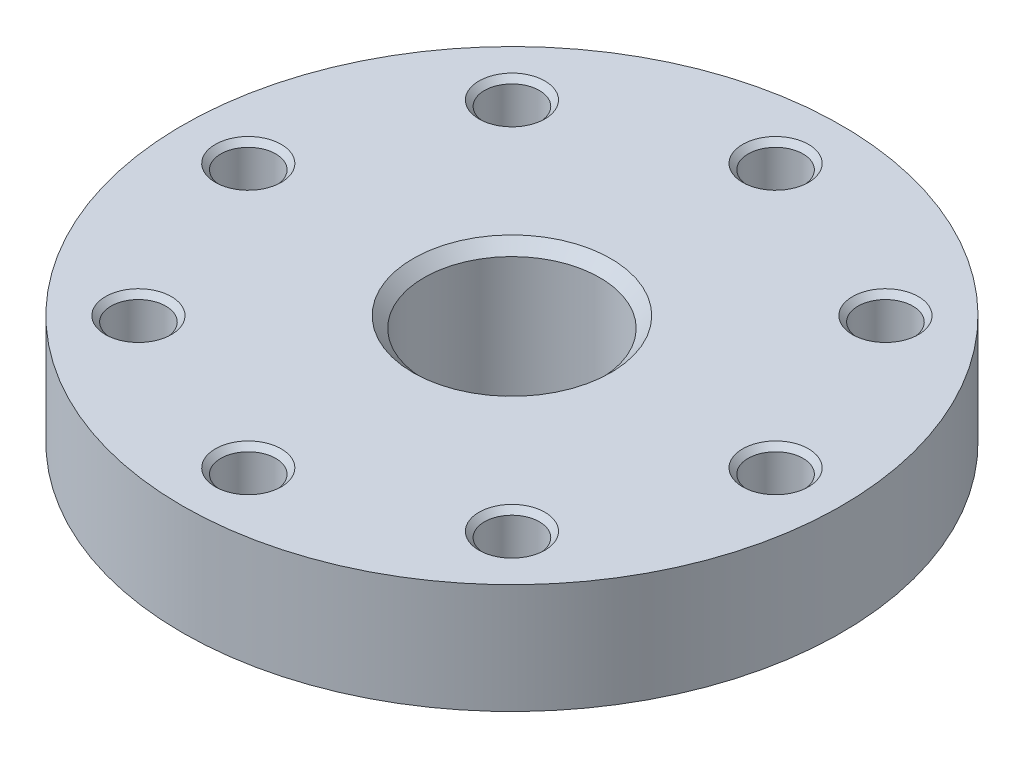
ISO-10303-21;
HEADER;
FILE_DESCRIPTION(('STEP AP214'),'2;1');
FILE_NAME('part.step','',(''),(''),'','','');
FILE_SCHEMA(('AUTOMOTIVE_DESIGN { 1 0 10303 214 1 1 1 1 }'));
ENDSEC;
DATA;
#1=APPLICATION_CONTEXT('core data for automotive mechanical design processes');
#2=APPLICATION_PROTOCOL_DEFINITION('international standard','automotive_design',2000,#1);
#3=PRODUCT_CONTEXT('',#1,'mechanical');
#4=PRODUCT('Part','Part','',(#3));
#5=PRODUCT_RELATED_PRODUCT_CATEGORY('part','',(#4));
#6=PRODUCT_DEFINITION_FORMATION('','',#4);
#7=PRODUCT_DEFINITION_CONTEXT('part definition',#1,'design');
#8=PRODUCT_DEFINITION('design','',#6,#7);
#9=PRODUCT_DEFINITION_SHAPE('','',#8);
#10=(LENGTH_UNIT() NAMED_UNIT(*) SI_UNIT(.MILLI.,.METRE.));
#11=(NAMED_UNIT(*) PLANE_ANGLE_UNIT() SI_UNIT($,.RADIAN.));
#12=(NAMED_UNIT(*) SI_UNIT($,.STERADIAN.) SOLID_ANGLE_UNIT());
#13=UNCERTAINTY_MEASURE_WITH_UNIT(LENGTH_MEASURE(1.E-05),#10,'distance_accuracy_value','');
#14=(GEOMETRIC_REPRESENTATION_CONTEXT(3) GLOBAL_UNCERTAINTY_ASSIGNED_CONTEXT((#13)) GLOBAL_UNIT_ASSIGNED_CONTEXT((#10,
#11,#12)) REPRESENTATION_CONTEXT('',''));
#15=CARTESIAN_POINT('',(0.,0.,0.));
#16=DIRECTION('',(0.,0.,1.));
#17=DIRECTION('',(1.,0.,0.));
#18=AXIS2_PLACEMENT_3D('',#15,#16,#17);
#19=CARTESIAN_POINT('',(0.,0.,0.));
#20=DIRECTION('',(0.,-1.,0.));
#21=DIRECTION('',(0.,0.,-1.));
#22=AXIS2_PLACEMENT_3D('',#19,#20,#21);
#23=CYLINDRICAL_SURFACE('',#22,1.5);
#24=CARTESIAN_POINT('',(0.,-1.5,0.));
#25=DIRECTION('',(0.,-1.,0.));
#26=DIRECTION('',(0.,0.,-1.));
#27=AXIS2_PLACEMENT_3D('',#24,#25,#26);
#28=CIRCLE('',#27,1.5);
#29=CARTESIAN_POINT('',(0.,-1.5,-1.5));
#30=VERTEX_POINT('',#29);
#31=EDGE_CURVE('E53',#30,#30,#28,.T.);
#32=ORIENTED_EDGE('',*,*,#31,.T.);
#33=EDGE_LOOP('',(#32));
#34=FACE_BOUND('',#33,.T.);
#35=CARTESIAN_POINT('',(0.,-1.,0.));
#36=DIRECTION('',(0.,1.,0.));
#37=DIRECTION('',(0.,0.,1.));
#38=AXIS2_PLACEMENT_3D('',#35,#36,#37);
#39=CIRCLE('',#38,1.5);
#40=CARTESIAN_POINT('',(0.,-1.,1.5));
#41=VERTEX_POINT('',#40);
#42=EDGE_CURVE('E51',#41,#41,#39,.F.);
#43=ORIENTED_EDGE('',*,*,#42,.F.);
#44=EDGE_LOOP('',(#43));
#45=FACE_BOUND('',#44,.T.);
#46=ADVANCED_FACE('F32',(#34,#45),#23,.F.);
#47=CARTESIAN_POINT('',(0.,5.,0.));
#48=DIRECTION('',(0.,-1.,0.));
#49=DIRECTION('',(0.,0.,-1.));
#50=AXIS2_PLACEMENT_3D('',#47,#48,#49);
#51=CYLINDRICAL_SURFACE('',#50,15.);
#52=CARTESIAN_POINT('',(0.,5.,0.));
#53=DIRECTION('',(0.,1.,0.));
#54=DIRECTION('',(0.,0.,1.));
#55=AXIS2_PLACEMENT_3D('',#52,#53,#54);
#56=CIRCLE('',#55,15.);
#57=CARTESIAN_POINT('',(0.,5.,15.));
#58=VERTEX_POINT('',#57);
#59=EDGE_CURVE('E148',#58,#58,#56,.T.);
#60=ORIENTED_EDGE('',*,*,#59,.F.);
#61=EDGE_LOOP('',(#60));
#62=FACE_BOUND('',#61,.T.);
#63=CARTESIAN_POINT('',(0.,0.,0.));
#64=DIRECTION('',(0.,1.,0.));
#65=DIRECTION('',(0.,0.,1.));
#66=AXIS2_PLACEMENT_3D('',#63,#64,#65);
#67=CIRCLE('',#66,15.);
#68=CARTESIAN_POINT('',(0.,0.,15.));
#69=VERTEX_POINT('',#68);
#70=EDGE_CURVE('E149',#69,#69,#67,.T.);
#71=ORIENTED_EDGE('',*,*,#70,.T.);
#72=EDGE_LOOP('',(#71));
#73=FACE_BOUND('',#72,.T.);
#74=ADVANCED_FACE('F180',(#62,#73),#51,.T.);
#75=CARTESIAN_POINT('',(0.,5.,0.));
#76=DIRECTION('',(0.,1.,0.));
#77=DIRECTION('',(0.,0.,1.));
#78=AXIS2_PLACEMENT_3D('',#75,#76,#77);
#79=PLANE('',#78);
#80=CARTESIAN_POINT('',(0.,5.,0.));
#81=DIRECTION('',(0.,1.,0.));
#82=DIRECTION('',(0.,0.,1.));
#83=AXIS2_PLACEMENT_3D('',#80,#81,#82);
#84=CIRCLE('',#83,4.5);
#85=CARTESIAN_POINT('',(0.,5.,4.5));
#86=VERTEX_POINT('',#85);
#87=EDGE_CURVE('E10',#86,#86,#84,.F.);
#88=ORIENTED_EDGE('',*,*,#87,.T.);
#89=EDGE_LOOP('',(#88));
#90=FACE_BOUND('',#89,.T.);
#91=CARTESIAN_POINT('',(8.5,5.,-8.5));
#92=DIRECTION('',(0.,1.,0.));
#93=DIRECTION('',(0.,0.,1.));
#94=AXIS2_PLACEMENT_3D('',#91,#92,#93);
#95=CIRCLE('',#94,1.49999999999999);
#96=CARTESIAN_POINT('',(8.5,5.,-7.00000000000001));
#97=VERTEX_POINT('',#96);
#98=EDGE_CURVE('E118',#97,#97,#95,.F.);
#99=ORIENTED_EDGE('',*,*,#98,.T.);
#100=EDGE_LOOP('',(#99));
#101=FACE_BOUND('',#100,.T.);
#102=CARTESIAN_POINT('',(0.,5.,-12.));
#103=DIRECTION('',(0.,1.,0.));
#104=DIRECTION('',(0.,0.,1.));
#105=AXIS2_PLACEMENT_3D('',#102,#103,#104);
#106=CIRCLE('',#105,1.49999999999999);
#107=CARTESIAN_POINT('',(0.,5.,-10.5));
#108=VERTEX_POINT('',#107);
#109=EDGE_CURVE('E121',#108,#108,#106,.F.);
#110=ORIENTED_EDGE('',*,*,#109,.T.);
#111=EDGE_LOOP('',(#110));
#112=FACE_BOUND('',#111,.T.);
#113=CARTESIAN_POINT('',(-8.5,5.,-8.5));
#114=DIRECTION('',(0.,1.,0.));
#115=DIRECTION('',(0.,0.,1.));
#116=AXIS2_PLACEMENT_3D('',#113,#114,#115);
#117=CIRCLE('',#116,1.49999999999999);
#118=CARTESIAN_POINT('',(-8.5,5.,-7.00000000000001));
#119=VERTEX_POINT('',#118);
#120=EDGE_CURVE('E124',#119,#119,#117,.F.);
#121=ORIENTED_EDGE('',*,*,#120,.T.);
#122=EDGE_LOOP('',(#121));
#123=FACE_BOUND('',#122,.T.);
#124=CARTESIAN_POINT('',(-12.,5.,0.));
#125=DIRECTION('',(0.,1.,0.));
#126=DIRECTION('',(0.,0.,1.));
#127=AXIS2_PLACEMENT_3D('',#124,#125,#126);
#128=CIRCLE('',#127,1.49999999999999);
#129=CARTESIAN_POINT('',(-12.,5.,1.49999999999999));
#130=VERTEX_POINT('',#129);
#131=EDGE_CURVE('E127',#130,#130,#128,.F.);
#132=ORIENTED_EDGE('',*,*,#131,.T.);
#133=EDGE_LOOP('',(#132));
#134=FACE_BOUND('',#133,.T.);
#135=CARTESIAN_POINT('',(-8.5,5.,8.5));
#136=DIRECTION('',(0.,1.,0.));
#137=DIRECTION('',(0.,0.,1.));
#138=AXIS2_PLACEMENT_3D('',#135,#136,#137);
#139=CIRCLE('',#138,1.49999999999999);
#140=CARTESIAN_POINT('',(-8.5,5.,9.99999999999999));
#141=VERTEX_POINT('',#140);
#142=EDGE_CURVE('E130',#141,#141,#139,.F.);
#143=ORIENTED_EDGE('',*,*,#142,.T.);
#144=EDGE_LOOP('',(#143));
#145=FACE_BOUND('',#144,.T.);
#146=CARTESIAN_POINT('',(0.,5.,12.));
#147=DIRECTION('',(0.,1.,0.));
#148=DIRECTION('',(0.,0.,1.));
#149=AXIS2_PLACEMENT_3D('',#146,#147,#148);
#150=CIRCLE('',#149,1.49999999999999);
#151=CARTESIAN_POINT('',(0.,5.,13.5));
#152=VERTEX_POINT('',#151);
#153=EDGE_CURVE('E133',#152,#152,#150,.F.);
#154=ORIENTED_EDGE('',*,*,#153,.T.);
#155=EDGE_LOOP('',(#154));
#156=FACE_BOUND('',#155,.T.);
#157=CARTESIAN_POINT('',(8.5,5.,8.5));
#158=DIRECTION('',(0.,1.,0.));
#159=DIRECTION('',(0.,0.,1.));
#160=AXIS2_PLACEMENT_3D('',#157,#158,#159);
#161=CIRCLE('',#160,1.49999999999999);
#162=CARTESIAN_POINT('',(8.5,5.,9.99999999999999));
#163=VERTEX_POINT('',#162);
#164=EDGE_CURVE('E136',#163,#163,#161,.F.);
#165=ORIENTED_EDGE('',*,*,#164,.T.);
#166=EDGE_LOOP('',(#165));
#167=FACE_BOUND('',#166,.T.);
#168=CARTESIAN_POINT('',(12.,5.,0.));
#169=DIRECTION('',(0.,1.,0.));
#170=DIRECTION('',(0.,0.,1.));
#171=AXIS2_PLACEMENT_3D('',#168,#169,#170);
#172=CIRCLE('',#171,1.49999999999999);
#173=CARTESIAN_POINT('',(12.,5.,1.49999999999999));
#174=VERTEX_POINT('',#173);
#175=EDGE_CURVE('E139',#174,#174,#172,.F.);
#176=ORIENTED_EDGE('',*,*,#175,.T.);
#177=EDGE_LOOP('',(#176));
#178=FACE_BOUND('',#177,.T.);
#179=ORIENTED_EDGE('',*,*,#59,.T.);
#180=EDGE_LOOP('',(#179));
#181=FACE_BOUND('',#180,.T.);
#182=ADVANCED_FACE('F185',(#90,#101,#112,#123,#134,#145,#156,#167,#178,#181),#79,.T.);
#183=CARTESIAN_POINT('',(0.,0.,0.));
#184=DIRECTION('',(0.,1.,0.));
#185=DIRECTION('',(0.,0.,1.));
#186=AXIS2_PLACEMENT_3D('',#183,#184,#185);
#187=PLANE('',#186);
#188=CARTESIAN_POINT('',(-12.,0.,0.));
#189=DIRECTION('',(0.,1.,0.));
#190=DIRECTION('',(0.,0.,1.));
#191=AXIS2_PLACEMENT_3D('',#188,#189,#190);
#192=CIRCLE('',#191,1.5);
#193=CARTESIAN_POINT('',(-12.,0.,1.5));
#194=VERTEX_POINT('',#193);
#195=EDGE_CURVE('E44',#194,#194,#192,.T.);
#196=ORIENTED_EDGE('',*,*,#195,.T.);
#197=EDGE_LOOP('',(#196));
#198=FACE_BOUND('',#197,.T.);
#199=CARTESIAN_POINT('',(-8.5,0.,-8.5));
#200=DIRECTION('',(0.,1.,0.));
#201=DIRECTION('',(0.,0.,1.));
#202=AXIS2_PLACEMENT_3D('',#199,#200,#201);
#203=CIRCLE('',#202,1.5);
#204=CARTESIAN_POINT('',(-8.5,0.,-7.));
#205=VERTEX_POINT('',#204);
#206=EDGE_CURVE('E48',#205,#205,#203,.T.);
#207=ORIENTED_EDGE('',*,*,#206,.T.);
#208=EDGE_LOOP('',(#207));
#209=FACE_BOUND('',#208,.T.);
#210=CARTESIAN_POINT('',(0.,0.,-12.));
#211=DIRECTION('',(0.,1.,0.));
#212=DIRECTION('',(0.,0.,1.));
#213=AXIS2_PLACEMENT_3D('',#210,#211,#212);
#214=CIRCLE('',#213,1.5);
#215=CARTESIAN_POINT('',(0.,0.,-10.5));
#216=VERTEX_POINT('',#215);
#217=EDGE_CURVE('E58',#216,#216,#214,.T.);
#218=ORIENTED_EDGE('',*,*,#217,.T.);
#219=EDGE_LOOP('',(#218));
#220=FACE_BOUND('',#219,.T.);
#221=CARTESIAN_POINT('',(8.5,0.,-8.5));
#222=DIRECTION('',(0.,1.,0.));
#223=DIRECTION('',(0.,0.,1.));
#224=AXIS2_PLACEMENT_3D('',#221,#222,#223);
#225=CIRCLE('',#224,1.5);
#226=CARTESIAN_POINT('',(8.5,0.,-7.));
#227=VERTEX_POINT('',#226);
#228=EDGE_CURVE('E61',#227,#227,#225,.T.);
#229=ORIENTED_EDGE('',*,*,#228,.T.);
#230=EDGE_LOOP('',(#229));
#231=FACE_BOUND('',#230,.T.);
#232=CARTESIAN_POINT('',(12.,0.,0.));
#233=DIRECTION('',(0.,1.,0.));
#234=DIRECTION('',(0.,0.,1.));
#235=AXIS2_PLACEMENT_3D('',#232,#233,#234);
#236=CIRCLE('',#235,1.5);
#237=CARTESIAN_POINT('',(12.,0.,1.49999999999999));
#238=VERTEX_POINT('',#237);
#239=EDGE_CURVE('E64',#238,#238,#236,.T.);
#240=ORIENTED_EDGE('',*,*,#239,.T.);
#241=EDGE_LOOP('',(#240));
#242=FACE_BOUND('',#241,.T.);
#243=CARTESIAN_POINT('',(8.5,0.,8.5));
#244=DIRECTION('',(0.,1.,0.));
#245=DIRECTION('',(0.,0.,1.));
#246=AXIS2_PLACEMENT_3D('',#243,#244,#245);
#247=CIRCLE('',#246,1.5);
#248=CARTESIAN_POINT('',(8.5,0.,10.));
#249=VERTEX_POINT('',#248);
#250=EDGE_CURVE('E67',#249,#249,#247,.T.);
#251=ORIENTED_EDGE('',*,*,#250,.T.);
#252=EDGE_LOOP('',(#251));
#253=FACE_BOUND('',#252,.T.);
#254=CARTESIAN_POINT('',(0.,0.,12.));
#255=DIRECTION('',(0.,1.,0.));
#256=DIRECTION('',(0.,0.,1.));
#257=AXIS2_PLACEMENT_3D('',#254,#255,#256);
#258=CIRCLE('',#257,1.5);
#259=CARTESIAN_POINT('',(0.,0.,13.5));
#260=VERTEX_POINT('',#259);
#261=EDGE_CURVE('E70',#260,#260,#258,.T.);
#262=ORIENTED_EDGE('',*,*,#261,.T.);
#263=EDGE_LOOP('',(#262));
#264=FACE_BOUND('',#263,.T.);
#265=CARTESIAN_POINT('',(-8.5,0.,8.5));
#266=DIRECTION('',(0.,1.,0.));
#267=DIRECTION('',(0.,0.,1.));
#268=AXIS2_PLACEMENT_3D('',#265,#266,#267);
#269=CIRCLE('',#268,1.5);
#270=CARTESIAN_POINT('',(-8.5,0.,10.));
#271=VERTEX_POINT('',#270);
#272=EDGE_CURVE('E73',#271,#271,#269,.T.);
#273=ORIENTED_EDGE('',*,*,#272,.T.);
#274=EDGE_LOOP('',(#273));
#275=FACE_BOUND('',#274,.T.);
#276=CARTESIAN_POINT('',(0.,0.,0.));
#277=DIRECTION('',(0.,1.,0.));
#278=DIRECTION('',(0.,0.,1.));
#279=AXIS2_PLACEMENT_3D('',#276,#277,#278);
#280=CIRCLE('',#279,6.);
#281=CARTESIAN_POINT('',(0.,0.,6.));
#282=VERTEX_POINT('',#281);
#283=EDGE_CURVE('E155',#282,#282,#280,.T.);
#284=ORIENTED_EDGE('',*,*,#283,.T.);
#285=EDGE_LOOP('',(#284));
#286=FACE_BOUND('',#285,.T.);
#287=ORIENTED_EDGE('',*,*,#70,.F.);
#288=EDGE_LOOP('',(#287));
#289=FACE_BOUND('',#288,.T.);
#290=ADVANCED_FACE('F224',(#198,#209,#220,#231,#242,#253,#264,#275,#286,#289),#187,.F.);
#291=CARTESIAN_POINT('',(-8.5,0.,8.5));
#292=DIRECTION('',(0.,1.,0.));
#293=DIRECTION('',(0.,0.,1.));
#294=AXIS2_PLACEMENT_3D('',#291,#292,#293);
#295=CYLINDRICAL_SURFACE('',#294,1.25);
#296=CARTESIAN_POINT('',(-8.5,4.75000000000001,8.5));
#297=DIRECTION('',(0.,1.,0.));
#298=DIRECTION('',(0.,0.,1.));
#299=AXIS2_PLACEMENT_3D('',#296,#297,#298);
#300=CIRCLE('',#299,1.25);
#301=CARTESIAN_POINT('',(-8.5,4.75000000000001,9.75));
#302=VERTEX_POINT('',#301);
#303=EDGE_CURVE('E94',#302,#302,#300,.T.);
#304=ORIENTED_EDGE('',*,*,#303,.T.);
#305=EDGE_LOOP('',(#304));
#306=FACE_BOUND('',#305,.T.);
#307=CARTESIAN_POINT('',(-8.5,0.25,8.5));
#308=DIRECTION('',(0.,1.,0.));
#309=DIRECTION('',(0.,0.,1.));
#310=AXIS2_PLACEMENT_3D('',#307,#308,#309);
#311=CIRCLE('',#310,1.25);
#312=CARTESIAN_POINT('',(-8.5,0.25,9.75));
#313=VERTEX_POINT('',#312);
#314=EDGE_CURVE('E97',#313,#313,#311,.F.);
#315=ORIENTED_EDGE('',*,*,#314,.T.);
#316=EDGE_LOOP('',(#315));
#317=FACE_BOUND('',#316,.T.);
#318=ADVANCED_FACE('F220',(#306,#317),#295,.F.);
#319=CARTESIAN_POINT('',(12.,0.,0.));
#320=DIRECTION('',(0.,1.,0.));
#321=DIRECTION('',(0.,0.,1.));
#322=AXIS2_PLACEMENT_3D('',#319,#320,#321);
#323=CYLINDRICAL_SURFACE('',#322,1.25);
#324=CARTESIAN_POINT('',(12.,4.75000000000001,0.));
#325=DIRECTION('',(0.,1.,0.));
#326=DIRECTION('',(0.,0.,1.));
#327=AXIS2_PLACEMENT_3D('',#324,#325,#326);
#328=CIRCLE('',#327,1.25);
#329=CARTESIAN_POINT('',(12.,4.75000000000001,1.25));
#330=VERTEX_POINT('',#329);
#331=EDGE_CURVE('E76',#330,#330,#328,.T.);
#332=ORIENTED_EDGE('',*,*,#331,.T.);
#333=EDGE_LOOP('',(#332));
#334=FACE_BOUND('',#333,.T.);
#335=CARTESIAN_POINT('',(12.,0.250000000000001,0.));
#336=DIRECTION('',(0.,1.,0.));
#337=DIRECTION('',(0.,0.,1.));
#338=AXIS2_PLACEMENT_3D('',#335,#336,#337);
#339=CIRCLE('',#338,1.25);
#340=CARTESIAN_POINT('',(12.,0.250000000000001,1.25));
#341=VERTEX_POINT('',#340);
#342=EDGE_CURVE('E79',#341,#341,#339,.F.);
#343=ORIENTED_EDGE('',*,*,#342,.T.);
#344=EDGE_LOOP('',(#343));
#345=FACE_BOUND('',#344,.T.);
#346=ADVANCED_FACE('F216',(#334,#345),#323,.F.);
#347=CARTESIAN_POINT('',(0.,0.,12.));
#348=DIRECTION('',(0.,1.,0.));
#349=DIRECTION('',(0.,0.,1.));
#350=AXIS2_PLACEMENT_3D('',#347,#348,#349);
#351=CYLINDRICAL_SURFACE('',#350,1.25);
#352=CARTESIAN_POINT('',(0.,4.75000000000001,12.));
#353=DIRECTION('',(0.,1.,0.));
#354=DIRECTION('',(0.,0.,1.));
#355=AXIS2_PLACEMENT_3D('',#352,#353,#354);
#356=CIRCLE('',#355,1.25);
#357=CARTESIAN_POINT('',(0.,4.75000000000001,13.25));
#358=VERTEX_POINT('',#357);
#359=EDGE_CURVE('E88',#358,#358,#356,.T.);
#360=ORIENTED_EDGE('',*,*,#359,.T.);
#361=EDGE_LOOP('',(#360));
#362=FACE_BOUND('',#361,.T.);
#363=CARTESIAN_POINT('',(0.,0.249999999999999,12.));
#364=DIRECTION('',(0.,1.,0.));
#365=DIRECTION('',(0.,0.,1.));
#366=AXIS2_PLACEMENT_3D('',#363,#364,#365);
#367=CIRCLE('',#366,1.25);
#368=CARTESIAN_POINT('',(0.,0.249999999999999,13.25));
#369=VERTEX_POINT('',#368);
#370=EDGE_CURVE('E91',#369,#369,#367,.F.);
#371=ORIENTED_EDGE('',*,*,#370,.T.);
#372=EDGE_LOOP('',(#371));
#373=FACE_BOUND('',#372,.T.);
#374=ADVANCED_FACE('F219',(#362,#373),#351,.F.);
#375=CARTESIAN_POINT('',(-12.,0.,0.));
#376=DIRECTION('',(0.,1.,0.));
#377=DIRECTION('',(0.,0.,1.));
#378=AXIS2_PLACEMENT_3D('',#375,#376,#377);
#379=CYLINDRICAL_SURFACE('',#378,1.25);
#380=CARTESIAN_POINT('',(-12.,4.75000000000001,0.));
#381=DIRECTION('',(0.,1.,0.));
#382=DIRECTION('',(0.,0.,1.));
#383=AXIS2_PLACEMENT_3D('',#380,#381,#382);
#384=CIRCLE('',#383,1.25);
#385=CARTESIAN_POINT('',(-12.,4.75000000000001,1.25));
#386=VERTEX_POINT('',#385);
#387=EDGE_CURVE('E100',#386,#386,#384,.T.);
#388=ORIENTED_EDGE('',*,*,#387,.T.);
#389=EDGE_LOOP('',(#388));
#390=FACE_BOUND('',#389,.T.);
#391=CARTESIAN_POINT('',(-12.,0.250000000000001,0.));
#392=DIRECTION('',(0.,1.,0.));
#393=DIRECTION('',(0.,0.,1.));
#394=AXIS2_PLACEMENT_3D('',#391,#392,#393);
#395=CIRCLE('',#394,1.25);
#396=CARTESIAN_POINT('',(-12.,0.250000000000001,1.25));
#397=VERTEX_POINT('',#396);
#398=EDGE_CURVE('E103',#397,#397,#395,.F.);
#399=ORIENTED_EDGE('',*,*,#398,.T.);
#400=EDGE_LOOP('',(#399));
#401=FACE_BOUND('',#400,.T.);
#402=ADVANCED_FACE('F208',(#390,#401),#379,.F.);
#403=CARTESIAN_POINT('',(-8.5,0.,-8.5));
#404=DIRECTION('',(0.,1.,0.));
#405=DIRECTION('',(0.,0.,1.));
#406=AXIS2_PLACEMENT_3D('',#403,#404,#405);
#407=CYLINDRICAL_SURFACE('',#406,1.25);
#408=CARTESIAN_POINT('',(-8.5,4.75000000000001,-8.5));
#409=DIRECTION('',(0.,1.,0.));
#410=DIRECTION('',(0.,0.,1.));
#411=AXIS2_PLACEMENT_3D('',#408,#409,#410);
#412=CIRCLE('',#411,1.25);
#413=CARTESIAN_POINT('',(-8.5,4.75000000000001,-7.25));
#414=VERTEX_POINT('',#413);
#415=EDGE_CURVE('E106',#414,#414,#412,.T.);
#416=ORIENTED_EDGE('',*,*,#415,.T.);
#417=EDGE_LOOP('',(#416));
#418=FACE_BOUND('',#417,.T.);
#419=CARTESIAN_POINT('',(-8.5,0.249999999999999,-8.5));
#420=DIRECTION('',(0.,1.,0.));
#421=DIRECTION('',(0.,0.,1.));
#422=AXIS2_PLACEMENT_3D('',#419,#420,#421);
#423=CIRCLE('',#422,1.25);
#424=CARTESIAN_POINT('',(-8.5,0.249999999999999,-7.25));
#425=VERTEX_POINT('',#424);
#426=EDGE_CURVE('E109',#425,#425,#423,.F.);
#427=ORIENTED_EDGE('',*,*,#426,.T.);
#428=EDGE_LOOP('',(#427));
#429=FACE_BOUND('',#428,.T.);
#430=ADVANCED_FACE('F204',(#418,#429),#407,.F.);
#431=CARTESIAN_POINT('',(8.5,0.,-8.5));
#432=DIRECTION('',(0.,1.,0.));
#433=DIRECTION('',(0.,0.,1.));
#434=AXIS2_PLACEMENT_3D('',#431,#432,#433);
#435=CYLINDRICAL_SURFACE('',#434,1.25);
#436=CARTESIAN_POINT('',(8.5,4.75000000000001,-8.5));
#437=DIRECTION('',(0.,1.,0.));
#438=DIRECTION('',(0.,0.,1.));
#439=AXIS2_PLACEMENT_3D('',#436,#437,#438);
#440=CIRCLE('',#439,1.25);
#441=CARTESIAN_POINT('',(8.5,4.75000000000001,-7.25));
#442=VERTEX_POINT('',#441);
#443=EDGE_CURVE('E142',#442,#442,#440,.T.);
#444=ORIENTED_EDGE('',*,*,#443,.T.);
#445=EDGE_LOOP('',(#444));
#446=FACE_BOUND('',#445,.T.);
#447=CARTESIAN_POINT('',(8.5,0.25,-8.5));
#448=DIRECTION('',(0.,1.,0.));
#449=DIRECTION('',(0.,0.,1.));
#450=AXIS2_PLACEMENT_3D('',#447,#448,#449);
#451=CIRCLE('',#450,1.25);
#452=CARTESIAN_POINT('',(8.5,0.25,-7.25));
#453=VERTEX_POINT('',#452);
#454=EDGE_CURVE('E145',#453,#453,#451,.F.);
#455=ORIENTED_EDGE('',*,*,#454,.T.);
#456=EDGE_LOOP('',(#455));
#457=FACE_BOUND('',#456,.T.);
#458=ADVANCED_FACE('F207',(#446,#457),#435,.F.);
#459=CARTESIAN_POINT('',(8.5,0.,8.5));
#460=DIRECTION('',(0.,1.,0.));
#461=DIRECTION('',(0.,0.,1.));
#462=AXIS2_PLACEMENT_3D('',#459,#460,#461);
#463=CYLINDRICAL_SURFACE('',#462,1.25);
#464=CARTESIAN_POINT('',(8.5,4.75000000000001,8.5));
#465=DIRECTION('',(0.,1.,0.));
#466=DIRECTION('',(0.,0.,1.));
#467=AXIS2_PLACEMENT_3D('',#464,#465,#466);
#468=CIRCLE('',#467,1.25);
#469=CARTESIAN_POINT('',(8.5,4.75000000000001,9.75));
#470=VERTEX_POINT('',#469);
#471=EDGE_CURVE('E82',#470,#470,#468,.T.);
#472=ORIENTED_EDGE('',*,*,#471,.T.);
#473=EDGE_LOOP('',(#472));
#474=FACE_BOUND('',#473,.T.);
#475=CARTESIAN_POINT('',(8.5,0.250000000000001,8.5));
#476=DIRECTION('',(0.,1.,0.));
#477=DIRECTION('',(0.,0.,1.));
#478=AXIS2_PLACEMENT_3D('',#475,#476,#477);
#479=CIRCLE('',#478,1.25);
#480=CARTESIAN_POINT('',(8.5,0.250000000000001,9.75));
#481=VERTEX_POINT('',#480);
#482=EDGE_CURVE('E85',#481,#481,#479,.F.);
#483=ORIENTED_EDGE('',*,*,#482,.T.);
#484=EDGE_LOOP('',(#483));
#485=FACE_BOUND('',#484,.T.);
#486=ADVANCED_FACE('F202',(#474,#485),#463,.F.);
#487=CARTESIAN_POINT('',(0.,0.,-12.));
#488=DIRECTION('',(0.,1.,0.));
#489=DIRECTION('',(0.,0.,1.));
#490=AXIS2_PLACEMENT_3D('',#487,#488,#489);
#491=CYLINDRICAL_SURFACE('',#490,1.25);
#492=CARTESIAN_POINT('',(0.,4.75000000000001,-12.));
#493=DIRECTION('',(0.,1.,0.));
#494=DIRECTION('',(0.,0.,1.));
#495=AXIS2_PLACEMENT_3D('',#492,#493,#494);
#496=CIRCLE('',#495,1.25);
#497=CARTESIAN_POINT('',(0.,4.75000000000001,-10.75));
#498=VERTEX_POINT('',#497);
#499=EDGE_CURVE('E112',#498,#498,#496,.T.);
#500=ORIENTED_EDGE('',*,*,#499,.T.);
#501=EDGE_LOOP('',(#500));
#502=FACE_BOUND('',#501,.T.);
#503=CARTESIAN_POINT('',(0.,0.249999999999999,-12.));
#504=DIRECTION('',(0.,1.,0.));
#505=DIRECTION('',(0.,0.,1.));
#506=AXIS2_PLACEMENT_3D('',#503,#504,#505);
#507=CIRCLE('',#506,1.25);
#508=CARTESIAN_POINT('',(0.,0.249999999999999,-10.75));
#509=VERTEX_POINT('',#508);
#510=EDGE_CURVE('E115',#509,#509,#507,.F.);
#511=ORIENTED_EDGE('',*,*,#510,.T.);
#512=EDGE_LOOP('',(#511));
#513=FACE_BOUND('',#512,.T.);
#514=ADVANCED_FACE('F198',(#502,#513),#491,.F.);
#515=CARTESIAN_POINT('',(0.,-1.5,0.));
#516=DIRECTION('',(0.,1.,0.));
#517=DIRECTION('',(0.,0.,1.));
#518=AXIS2_PLACEMENT_3D('',#515,#516,#517);
#519=CYLINDRICAL_SURFACE('',#518,6.);
#520=CARTESIAN_POINT('',(0.,-1.5,0.));
#521=DIRECTION('',(0.,1.,0.));
#522=DIRECTION('',(0.,0.,1.));
#523=AXIS2_PLACEMENT_3D('',#520,#521,#522);
#524=CIRCLE('',#523,6.);
#525=CARTESIAN_POINT('',(0.,-1.5,6.));
#526=VERTEX_POINT('',#525);
#527=EDGE_CURVE('E152',#526,#526,#524,.T.);
#528=ORIENTED_EDGE('',*,*,#527,.T.);
#529=EDGE_LOOP('',(#528));
#530=FACE_BOUND('',#529,.T.);
#531=ORIENTED_EDGE('',*,*,#283,.F.);
#532=EDGE_LOOP('',(#531));
#533=FACE_BOUND('',#532,.T.);
#534=ADVANCED_FACE('F194',(#530,#533),#519,.T.);
#535=CARTESIAN_POINT('',(0.,-1.5,0.));
#536=DIRECTION('',(0.,1.,0.));
#537=DIRECTION('',(0.,0.,1.));
#538=AXIS2_PLACEMENT_3D('',#535,#536,#537);
#539=PLANE('',#538);
#540=ORIENTED_EDGE('',*,*,#31,.F.);
#541=EDGE_LOOP('',(#540));
#542=FACE_BOUND('',#541,.T.);
#543=ORIENTED_EDGE('',*,*,#527,.F.);
#544=EDGE_LOOP('',(#543));
#545=FACE_BOUND('',#544,.T.);
#546=ADVANCED_FACE('F190',(#542,#545),#539,.F.);
#547=CARTESIAN_POINT('',(8.5,4.75000000000001,-8.5));
#548=DIRECTION('',(0.,1.,0.));
#549=DIRECTION('',(0.,0.,1.));
#550=AXIS2_PLACEMENT_3D('',#547,#548,#549);
#551=CONICAL_SURFACE('',#550,1.25,0.785398163397454);
#552=ORIENTED_EDGE('',*,*,#98,.F.);
#553=EDGE_LOOP('',(#552));
#554=FACE_BOUND('',#553,.T.);
#555=ORIENTED_EDGE('',*,*,#443,.F.);
#556=EDGE_LOOP('',(#555));
#557=FACE_BOUND('',#556,.T.);
#558=ADVANCED_FACE('F193',(#554,#557),#551,.F.);
#559=CARTESIAN_POINT('',(0.,4.75000000000001,-12.));
#560=DIRECTION('',(0.,1.,0.));
#561=DIRECTION('',(0.,0.,1.));
#562=AXIS2_PLACEMENT_3D('',#559,#560,#561);
#563=CONICAL_SURFACE('',#562,1.25,0.785398163397454);
#564=ORIENTED_EDGE('',*,*,#109,.F.);
#565=EDGE_LOOP('',(#564));
#566=FACE_BOUND('',#565,.T.);
#567=ORIENTED_EDGE('',*,*,#499,.F.);
#568=EDGE_LOOP('',(#567));
#569=FACE_BOUND('',#568,.T.);
#570=ADVANCED_FACE('F243',(#566,#569),#563,.F.);
#571=CARTESIAN_POINT('',(-8.5,4.75000000000001,-8.5));
#572=DIRECTION('',(0.,1.,0.));
#573=DIRECTION('',(0.,0.,1.));
#574=AXIS2_PLACEMENT_3D('',#571,#572,#573);
#575=CONICAL_SURFACE('',#574,1.25,0.785398163397454);
#576=ORIENTED_EDGE('',*,*,#120,.F.);
#577=EDGE_LOOP('',(#576));
#578=FACE_BOUND('',#577,.T.);
#579=ORIENTED_EDGE('',*,*,#415,.F.);
#580=EDGE_LOOP('',(#579));
#581=FACE_BOUND('',#580,.T.);
#582=ADVANCED_FACE('F250',(#578,#581),#575,.F.);
#583=CARTESIAN_POINT('',(-12.,4.75000000000001,0.));
#584=DIRECTION('',(0.,1.,0.));
#585=DIRECTION('',(0.,0.,1.));
#586=AXIS2_PLACEMENT_3D('',#583,#584,#585);
#587=CONICAL_SURFACE('',#586,1.25,0.785398163397453);
#588=ORIENTED_EDGE('',*,*,#131,.F.);
#589=EDGE_LOOP('',(#588));
#590=FACE_BOUND('',#589,.T.);
#591=ORIENTED_EDGE('',*,*,#387,.F.);
#592=EDGE_LOOP('',(#591));
#593=FACE_BOUND('',#592,.T.);
#594=ADVANCED_FACE('F257',(#590,#593),#587,.F.);
#595=CARTESIAN_POINT('',(-8.5,4.75000000000001,8.5));
#596=DIRECTION('',(0.,1.,0.));
#597=DIRECTION('',(0.,0.,1.));
#598=AXIS2_PLACEMENT_3D('',#595,#596,#597);
#599=CONICAL_SURFACE('',#598,1.25,0.785398163397454);
#600=ORIENTED_EDGE('',*,*,#142,.F.);
#601=EDGE_LOOP('',(#600));
#602=FACE_BOUND('',#601,.T.);
#603=ORIENTED_EDGE('',*,*,#303,.F.);
#604=EDGE_LOOP('',(#603));
#605=FACE_BOUND('',#604,.T.);
#606=ADVANCED_FACE('F264',(#602,#605),#599,.F.);
#607=CARTESIAN_POINT('',(0.,4.75000000000001,12.));
#608=DIRECTION('',(0.,1.,0.));
#609=DIRECTION('',(0.,0.,1.));
#610=AXIS2_PLACEMENT_3D('',#607,#608,#609);
#611=CONICAL_SURFACE('',#610,1.25,0.785398163397454);
#612=ORIENTED_EDGE('',*,*,#153,.F.);
#613=EDGE_LOOP('',(#612));
#614=FACE_BOUND('',#613,.T.);
#615=ORIENTED_EDGE('',*,*,#359,.F.);
#616=EDGE_LOOP('',(#615));
#617=FACE_BOUND('',#616,.T.);
#618=ADVANCED_FACE('F271',(#614,#617),#611,.F.);
#619=CARTESIAN_POINT('',(8.5,4.75000000000001,8.5));
#620=DIRECTION('',(0.,1.,0.));
#621=DIRECTION('',(0.,0.,1.));
#622=AXIS2_PLACEMENT_3D('',#619,#620,#621);
#623=CONICAL_SURFACE('',#622,1.25,0.785398163397454);
#624=ORIENTED_EDGE('',*,*,#164,.F.);
#625=EDGE_LOOP('',(#624));
#626=FACE_BOUND('',#625,.T.);
#627=ORIENTED_EDGE('',*,*,#471,.F.);
#628=EDGE_LOOP('',(#627));
#629=FACE_BOUND('',#628,.T.);
#630=ADVANCED_FACE('F278',(#626,#629),#623,.F.);
#631=CARTESIAN_POINT('',(12.,4.75000000000001,0.));
#632=DIRECTION('',(0.,1.,0.));
#633=DIRECTION('',(0.,0.,1.));
#634=AXIS2_PLACEMENT_3D('',#631,#632,#633);
#635=CONICAL_SURFACE('',#634,1.25,0.785398163397453);
#636=ORIENTED_EDGE('',*,*,#175,.F.);
#637=EDGE_LOOP('',(#636));
#638=FACE_BOUND('',#637,.T.);
#639=ORIENTED_EDGE('',*,*,#331,.F.);
#640=EDGE_LOOP('',(#639));
#641=FACE_BOUND('',#640,.T.);
#642=ADVANCED_FACE('F285',(#638,#641),#635,.F.);
#643=CARTESIAN_POINT('',(-12.,0.,0.));
#644=DIRECTION('',(0.,-1.,0.));
#645=DIRECTION('',(0.,0.,-1.));
#646=AXIS2_PLACEMENT_3D('',#643,#644,#645);
#647=CONICAL_SURFACE('',#646,1.5,0.785398163397443);
#648=ORIENTED_EDGE('',*,*,#398,.F.);
#649=EDGE_LOOP('',(#648));
#650=FACE_BOUND('',#649,.T.);
#651=ORIENTED_EDGE('',*,*,#195,.F.);
#652=EDGE_LOOP('',(#651));
#653=FACE_BOUND('',#652,.T.);
#654=ADVANCED_FACE('F292',(#650,#653),#647,.F.);
#655=CARTESIAN_POINT('',(-8.5,0.,-8.5));
#656=DIRECTION('',(0.,-1.,0.));
#657=DIRECTION('',(0.,0.,-1.));
#658=AXIS2_PLACEMENT_3D('',#655,#656,#657);
#659=CONICAL_SURFACE('',#658,1.5,0.785398163397447);
#660=ORIENTED_EDGE('',*,*,#426,.F.);
#661=EDGE_LOOP('',(#660));
#662=FACE_BOUND('',#661,.T.);
#663=ORIENTED_EDGE('',*,*,#206,.F.);
#664=EDGE_LOOP('',(#663));
#665=FACE_BOUND('',#664,.T.);
#666=ADVANCED_FACE('F299',(#662,#665),#659,.F.);
#667=CARTESIAN_POINT('',(0.,0.,-12.));
#668=DIRECTION('',(0.,-1.,0.));
#669=DIRECTION('',(0.,0.,-1.));
#670=AXIS2_PLACEMENT_3D('',#667,#668,#669);
#671=CONICAL_SURFACE('',#670,1.5,0.785398163397447);
#672=ORIENTED_EDGE('',*,*,#510,.F.);
#673=EDGE_LOOP('',(#672));
#674=FACE_BOUND('',#673,.T.);
#675=ORIENTED_EDGE('',*,*,#217,.F.);
#676=EDGE_LOOP('',(#675));
#677=FACE_BOUND('',#676,.T.);
#678=ADVANCED_FACE('F306',(#674,#677),#671,.F.);
#679=CARTESIAN_POINT('',(8.5,0.,-8.5));
#680=DIRECTION('',(0.,-1.,0.));
#681=DIRECTION('',(0.,0.,-1.));
#682=AXIS2_PLACEMENT_3D('',#679,#680,#681);
#683=CONICAL_SURFACE('',#682,1.5,0.785398163397447);
#684=ORIENTED_EDGE('',*,*,#454,.F.);
#685=EDGE_LOOP('',(#684));
#686=FACE_BOUND('',#685,.T.);
#687=ORIENTED_EDGE('',*,*,#228,.F.);
#688=EDGE_LOOP('',(#687));
#689=FACE_BOUND('',#688,.T.);
#690=ADVANCED_FACE('F313',(#686,#689),#683,.F.);
#691=CARTESIAN_POINT('',(12.,0.,0.));
#692=DIRECTION('',(0.,-1.,0.));
#693=DIRECTION('',(0.,0.,-1.));
#694=AXIS2_PLACEMENT_3D('',#691,#692,#693);
#695=CONICAL_SURFACE('',#694,1.5,0.785398163397443);
#696=ORIENTED_EDGE('',*,*,#342,.F.);
#697=EDGE_LOOP('',(#696));
#698=FACE_BOUND('',#697,.T.);
#699=ORIENTED_EDGE('',*,*,#239,.F.);
#700=EDGE_LOOP('',(#699));
#701=FACE_BOUND('',#700,.T.);
#702=ADVANCED_FACE('F320',(#698,#701),#695,.F.);
#703=CARTESIAN_POINT('',(8.5,0.,8.5));
#704=DIRECTION('',(0.,-1.,0.));
#705=DIRECTION('',(0.,0.,-1.));
#706=AXIS2_PLACEMENT_3D('',#703,#704,#705);
#707=CONICAL_SURFACE('',#706,1.5,0.785398163397443);
#708=ORIENTED_EDGE('',*,*,#482,.F.);
#709=EDGE_LOOP('',(#708));
#710=FACE_BOUND('',#709,.T.);
#711=ORIENTED_EDGE('',*,*,#250,.F.);
#712=EDGE_LOOP('',(#711));
#713=FACE_BOUND('',#712,.T.);
#714=ADVANCED_FACE('F327',(#710,#713),#707,.F.);
#715=CARTESIAN_POINT('',(0.,0.,12.));
#716=DIRECTION('',(0.,-1.,0.));
#717=DIRECTION('',(0.,0.,-1.));
#718=AXIS2_PLACEMENT_3D('',#715,#716,#717);
#719=CONICAL_SURFACE('',#718,1.5,0.785398163397447);
#720=ORIENTED_EDGE('',*,*,#370,.F.);
#721=EDGE_LOOP('',(#720));
#722=FACE_BOUND('',#721,.T.);
#723=ORIENTED_EDGE('',*,*,#261,.F.);
#724=EDGE_LOOP('',(#723));
#725=FACE_BOUND('',#724,.T.);
#726=ADVANCED_FACE('F334',(#722,#725),#719,.F.);
#727=CARTESIAN_POINT('',(-8.5,0.,8.5));
#728=DIRECTION('',(0.,-1.,0.));
#729=DIRECTION('',(0.,0.,-1.));
#730=AXIS2_PLACEMENT_3D('',#727,#728,#729);
#731=CONICAL_SURFACE('',#730,1.5,0.785398163397443);
#732=ORIENTED_EDGE('',*,*,#314,.F.);
#733=EDGE_LOOP('',(#732));
#734=FACE_BOUND('',#733,.T.);
#735=ORIENTED_EDGE('',*,*,#272,.F.);
#736=EDGE_LOOP('',(#735));
#737=FACE_BOUND('',#736,.T.);
#738=ADVANCED_FACE('F176',(#734,#737),#731,.F.);
#739=CARTESIAN_POINT('',(0.,-1.,0.));
#740=DIRECTION('',(0.,1.,0.));
#741=DIRECTION('',(0.,0.,1.));
#742=AXIS2_PLACEMENT_3D('',#739,#740,#741);
#743=PLANE('',#742);
#744=CARTESIAN_POINT('',(0.,-1.,0.));
#745=DIRECTION('',(0.,1.,0.));
#746=DIRECTION('',(0.,0.,1.));
#747=AXIS2_PLACEMENT_3D('',#744,#745,#746);
#748=CIRCLE('',#747,4.);
#749=CARTESIAN_POINT('',(0.,-1.,4.));
#750=VERTEX_POINT('',#749);
#751=EDGE_CURVE('E54',#750,#750,#748,.T.);
#752=ORIENTED_EDGE('',*,*,#751,.T.);
#753=EDGE_LOOP('',(#752));
#754=FACE_BOUND('',#753,.T.);
#755=ORIENTED_EDGE('',*,*,#42,.T.);
#756=EDGE_LOOP('',(#755));
#757=FACE_BOUND('',#756,.T.);
#758=ADVANCED_FACE('F165',(#754,#757),#743,.T.);
#759=CARTESIAN_POINT('',(0.,-1.,0.));
#760=DIRECTION('',(0.,1.,0.));
#761=DIRECTION('',(0.,0.,1.));
#762=AXIS2_PLACEMENT_3D('',#759,#760,#761);
#763=CYLINDRICAL_SURFACE('',#762,4.);
#764=CARTESIAN_POINT('',(0.,4.5,0.));
#765=DIRECTION('',(0.,1.,0.));
#766=DIRECTION('',(0.,0.,1.));
#767=AXIS2_PLACEMENT_3D('',#764,#765,#766);
#768=CIRCLE('',#767,4.);
#769=CARTESIAN_POINT('',(0.,4.5,4.));
#770=VERTEX_POINT('',#769);
#771=EDGE_CURVE('E40',#770,#770,#768,.T.);
#772=ORIENTED_EDGE('',*,*,#771,.T.);
#773=EDGE_LOOP('',(#772));
#774=FACE_BOUND('',#773,.T.);
#775=ORIENTED_EDGE('',*,*,#751,.F.);
#776=EDGE_LOOP('',(#775));
#777=FACE_BOUND('',#776,.T.);
#778=ADVANCED_FACE('F168',(#774,#777),#763,.F.);
#779=CARTESIAN_POINT('',(0.,4.5,0.));
#780=DIRECTION('',(0.,1.,0.));
#781=DIRECTION('',(0.,0.,1.));
#782=AXIS2_PLACEMENT_3D('',#779,#780,#781);
#783=CONICAL_SURFACE('',#782,4.,0.785398163397448);
#784=ORIENTED_EDGE('',*,*,#87,.F.);
#785=EDGE_LOOP('',(#784));
#786=FACE_BOUND('',#785,.T.);
#787=ORIENTED_EDGE('',*,*,#771,.F.);
#788=EDGE_LOOP('',(#787));
#789=FACE_BOUND('',#788,.T.);
#790=ADVANCED_FACE('F35',(#786,#789),#783,.F.);
#791=CLOSED_SHELL('',(#46,#74,#182,#290,#318,#346,#374,#402,#430,#458,#486,#514,#534,#546,#558,
#570,#582,#594,#606,#618,#630,#642,#654,#666,#678,#690,#702,#714,#726,#738,#758,#778,#790));
#792=MANIFOLD_SOLID_BREP('B2',#791);
#793=ADVANCED_BREP_SHAPE_REPRESENTATION('',(#18,#792),#14);
#794=SHAPE_DEFINITION_REPRESENTATION(#9,#793);
ENDSEC;
END-ISO-10303-21;
